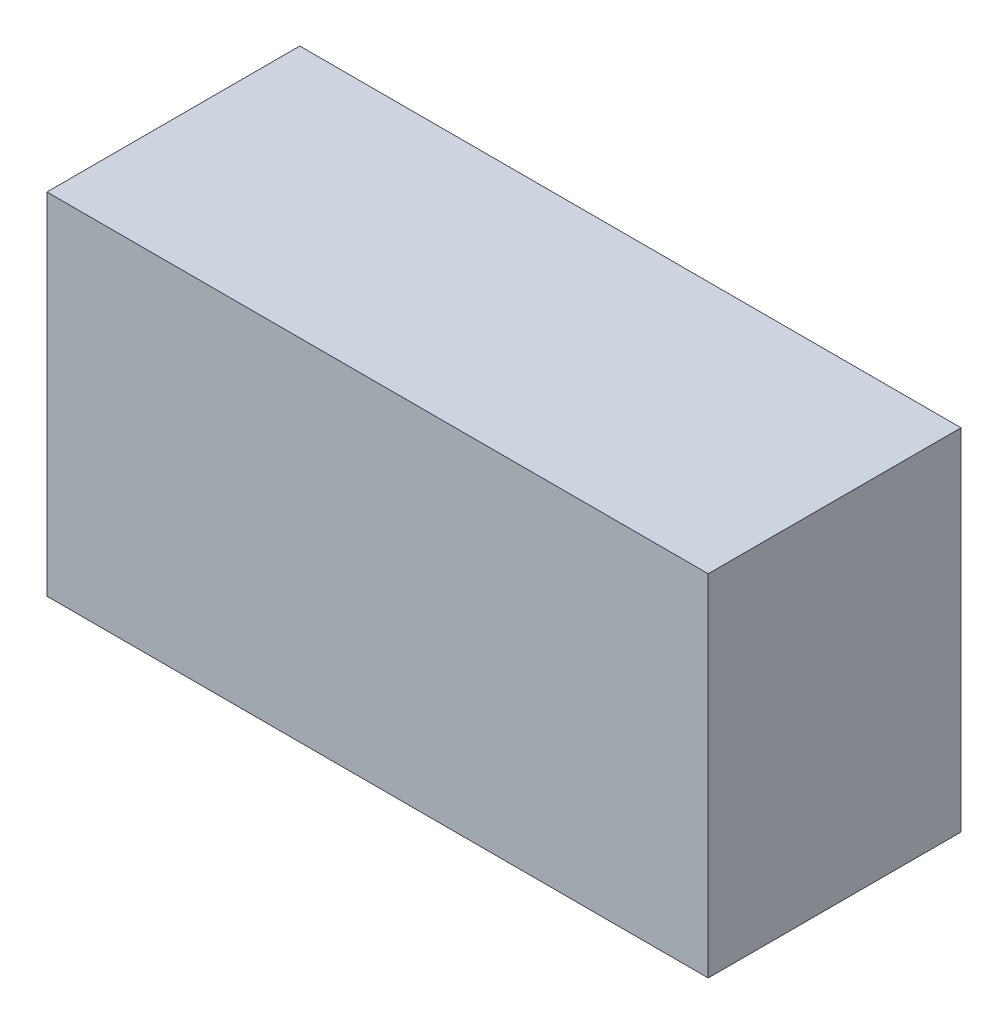
ISO-10303-21;
HEADER;
FILE_DESCRIPTION(('STEP AP214'),'2;1');
FILE_NAME('part.step','',(''),(''),'','','');
FILE_SCHEMA(('AUTOMOTIVE_DESIGN { 1 0 10303 214 1 1 1 1 }'));
ENDSEC;
DATA;
#1=APPLICATION_CONTEXT('core data for automotive mechanical design processes');
#2=APPLICATION_PROTOCOL_DEFINITION('international standard','automotive_design',2000,#1);
#3=PRODUCT_CONTEXT('',#1,'mechanical');
#4=PRODUCT('Part','Part','',(#3));
#5=PRODUCT_RELATED_PRODUCT_CATEGORY('part','',(#4));
#6=PRODUCT_DEFINITION_FORMATION('','',#4);
#7=PRODUCT_DEFINITION_CONTEXT('part definition',#1,'design');
#8=PRODUCT_DEFINITION('design','',#6,#7);
#9=PRODUCT_DEFINITION_SHAPE('','',#8);
#10=(LENGTH_UNIT() NAMED_UNIT(*) SI_UNIT(.MILLI.,.METRE.));
#11=(NAMED_UNIT(*) PLANE_ANGLE_UNIT() SI_UNIT($,.RADIAN.));
#12=(NAMED_UNIT(*) SI_UNIT($,.STERADIAN.) SOLID_ANGLE_UNIT());
#13=UNCERTAINTY_MEASURE_WITH_UNIT(LENGTH_MEASURE(1.E-05),#10,'distance_accuracy_value','');
#14=(GEOMETRIC_REPRESENTATION_CONTEXT(3) GLOBAL_UNCERTAINTY_ASSIGNED_CONTEXT((#13)) GLOBAL_UNIT_ASSIGNED_CONTEXT((#10,
#11,#12)) REPRESENTATION_CONTEXT('',''));
#15=CARTESIAN_POINT('',(0.,0.,0.));
#16=DIRECTION('',(0.,0.,1.));
#17=DIRECTION('',(1.,0.,0.));
#18=AXIS2_PLACEMENT_3D('',#15,#16,#17);
#19=CARTESIAN_POINT('',(-1.69999914,-0.90000074,1.29999994));
#20=DIRECTION('',(0.,0.,-1.));
#21=DIRECTION('',(-1.,0.,0.));
#22=AXIS2_PLACEMENT_3D('',#19,#20,#21);
#23=PLANE('',#22);
#24=DIRECTION('',(0.,1.,0.));
#25=VECTOR('',#24,1.);
#26=CARTESIAN_POINT('',(1.69999914,-0.90000074,1.29999994));
#27=LINE('',#26,#25);
#28=CARTESIAN_POINT('',(1.69999914,-0.90000074,1.29999994));
#29=VERTEX_POINT('',#28);
#30=CARTESIAN_POINT('',(1.69999914,0.90000074,1.29999994));
#31=VERTEX_POINT('',#30);
#32=EDGE_CURVE('E54',#29,#31,#27,.T.);
#33=ORIENTED_EDGE('',*,*,#32,.T.);
#34=DIRECTION('',(1.,0.,0.));
#35=VECTOR('',#34,1.);
#36=CARTESIAN_POINT('',(1.69999914,0.90000074,1.29999994));
#37=LINE('',#36,#35);
#38=CARTESIAN_POINT('',(-1.69999914,0.90000074,1.29999994));
#39=VERTEX_POINT('',#38);
#40=EDGE_CURVE('E56',#31,#39,#37,.F.);
#41=ORIENTED_EDGE('',*,*,#40,.T.);
#42=DIRECTION('',(0.,1.,0.));
#43=VECTOR('',#42,1.);
#44=CARTESIAN_POINT('',(-1.69999914,0.90000074,1.29999994));
#45=LINE('',#44,#43);
#46=CARTESIAN_POINT('',(-1.69999914,-0.90000074,1.29999994));
#47=VERTEX_POINT('',#46);
#48=EDGE_CURVE('E19',#39,#47,#45,.F.);
#49=ORIENTED_EDGE('',*,*,#48,.T.);
#50=DIRECTION('',(1.,0.,0.));
#51=VECTOR('',#50,1.);
#52=CARTESIAN_POINT('',(-1.69999914,-0.90000074,1.29999994));
#53=LINE('',#52,#51);
#54=EDGE_CURVE('E79',#47,#29,#53,.T.);
#55=ORIENTED_EDGE('',*,*,#54,.T.);
#56=EDGE_LOOP('',(#33,#41,#49,#55));
#57=FACE_BOUND('',#56,.T.);
#58=ADVANCED_FACE('F16',(#57),#23,.F.);
#59=CARTESIAN_POINT('',(-1.69999914,0.90000074,0.));
#60=DIRECTION('',(1.,0.,0.));
#61=DIRECTION('',(0.,0.,-1.));
#62=AXIS2_PLACEMENT_3D('',#59,#60,#61);
#63=PLANE('',#62);
#64=DIRECTION('',(0.,0.,1.));
#65=VECTOR('',#64,1.);
#66=CARTESIAN_POINT('',(-1.69999914,-0.90000074,0.));
#67=LINE('',#66,#65);
#68=CARTESIAN_POINT('',(-1.69999914,-0.90000074,0.));
#69=VERTEX_POINT('',#68);
#70=EDGE_CURVE('E67',#69,#47,#67,.T.);
#71=ORIENTED_EDGE('',*,*,#70,.T.);
#72=ORIENTED_EDGE('',*,*,#48,.F.);
#73=DIRECTION('',(0.,0.,-1.));
#74=VECTOR('',#73,1.);
#75=CARTESIAN_POINT('',(-1.69999914,0.90000074,0.));
#76=LINE('',#75,#74);
#77=CARTESIAN_POINT('',(-1.69999914,0.90000074,0.));
#78=VERTEX_POINT('',#77);
#79=EDGE_CURVE('E62',#39,#78,#76,.T.);
#80=ORIENTED_EDGE('',*,*,#79,.T.);
#81=DIRECTION('',(0.,1.,0.));
#82=VECTOR('',#81,1.);
#83=CARTESIAN_POINT('',(-1.69999914,-0.90000074,0.));
#84=LINE('',#83,#82);
#85=EDGE_CURVE('E82',#69,#78,#84,.T.);
#86=ORIENTED_EDGE('',*,*,#85,.F.);
#87=EDGE_LOOP('',(#71,#72,#80,#86));
#88=FACE_BOUND('',#87,.T.);
#89=ADVANCED_FACE('F64',(#88),#63,.F.);
#90=CARTESIAN_POINT('',(1.69999914,0.90000074,0.));
#91=DIRECTION('',(0.,-1.,0.));
#92=DIRECTION('',(0.,0.,-1.));
#93=AXIS2_PLACEMENT_3D('',#90,#91,#92);
#94=PLANE('',#93);
#95=ORIENTED_EDGE('',*,*,#79,.F.);
#96=ORIENTED_EDGE('',*,*,#40,.F.);
#97=DIRECTION('',(0.,0.,1.));
#98=VECTOR('',#97,1.);
#99=CARTESIAN_POINT('',(1.69999914,0.90000074,0.));
#100=LINE('',#99,#98);
#101=CARTESIAN_POINT('',(1.69999914,0.90000074,0.));
#102=VERTEX_POINT('',#101);
#103=EDGE_CURVE('E74',#31,#102,#100,.F.);
#104=ORIENTED_EDGE('',*,*,#103,.T.);
#105=DIRECTION('',(-1.,0.,0.));
#106=VECTOR('',#105,1.);
#107=CARTESIAN_POINT('',(-1.69999914,0.90000074,0.));
#108=LINE('',#107,#106);
#109=EDGE_CURVE('E71',#78,#102,#108,.F.);
#110=ORIENTED_EDGE('',*,*,#109,.F.);
#111=EDGE_LOOP('',(#95,#96,#104,#110));
#112=FACE_BOUND('',#111,.T.);
#113=ADVANCED_FACE('F69',(#112),#94,.F.);
#114=CARTESIAN_POINT('',(1.69999914,-0.90000074,0.));
#115=DIRECTION('',(-1.,0.,0.));
#116=DIRECTION('',(0.,0.,1.));
#117=AXIS2_PLACEMENT_3D('',#114,#115,#116);
#118=PLANE('',#117);
#119=ORIENTED_EDGE('',*,*,#103,.F.);
#120=ORIENTED_EDGE('',*,*,#32,.F.);
#121=DIRECTION('',(0.,0.,1.));
#122=VECTOR('',#121,1.);
#123=CARTESIAN_POINT('',(1.69999914,-0.90000074,0.));
#124=LINE('',#123,#122);
#125=CARTESIAN_POINT('',(1.69999914,-0.90000074,0.));
#126=VERTEX_POINT('',#125);
#127=EDGE_CURVE('E34',#29,#126,#124,.F.);
#128=ORIENTED_EDGE('',*,*,#127,.T.);
#129=DIRECTION('',(0.,1.,0.));
#130=VECTOR('',#129,1.);
#131=CARTESIAN_POINT('',(1.69999914,-0.90000074,0.));
#132=LINE('',#131,#130);
#133=EDGE_CURVE('E25',#102,#126,#132,.F.);
#134=ORIENTED_EDGE('',*,*,#133,.F.);
#135=EDGE_LOOP('',(#119,#120,#128,#134));
#136=FACE_BOUND('',#135,.T.);
#137=ADVANCED_FACE('F88',(#136),#118,.F.);
#138=CARTESIAN_POINT('',(-1.69999914,-0.90000074,0.));
#139=DIRECTION('',(0.,1.,0.));
#140=DIRECTION('',(0.,0.,1.));
#141=AXIS2_PLACEMENT_3D('',#138,#139,#140);
#142=PLANE('',#141);
#143=ORIENTED_EDGE('',*,*,#127,.F.);
#144=ORIENTED_EDGE('',*,*,#54,.F.);
#145=ORIENTED_EDGE('',*,*,#70,.F.);
#146=DIRECTION('',(-1.,0.,0.));
#147=VECTOR('',#146,1.);
#148=CARTESIAN_POINT('',(-1.69999914,-0.90000074,0.));
#149=LINE('',#148,#147);
#150=EDGE_CURVE('E11',#126,#69,#149,.T.);
#151=ORIENTED_EDGE('',*,*,#150,.F.);
#152=EDGE_LOOP('',(#143,#144,#145,#151));
#153=FACE_BOUND('',#152,.T.);
#154=ADVANCED_FACE('F90',(#153),#142,.F.);
#155=CARTESIAN_POINT('',(-1.69999914,-0.90000074,0.));
#156=DIRECTION('',(0.,0.,-1.));
#157=DIRECTION('',(-1.,0.,0.));
#158=AXIS2_PLACEMENT_3D('',#155,#156,#157);
#159=PLANE('',#158);
#160=ORIENTED_EDGE('',*,*,#133,.T.);
#161=ORIENTED_EDGE('',*,*,#150,.T.);
#162=ORIENTED_EDGE('',*,*,#85,.T.);
#163=ORIENTED_EDGE('',*,*,#109,.T.);
#164=EDGE_LOOP('',(#160,#161,#162,#163));
#165=FACE_BOUND('',#164,.T.);
#166=ADVANCED_FACE('F87',(#165),#159,.T.);
#167=CLOSED_SHELL('',(#58,#89,#113,#137,#154,#166));
#168=MANIFOLD_SOLID_BREP('B1',#167);
#169=ADVANCED_BREP_SHAPE_REPRESENTATION('',(#18,#168),#14);
#170=SHAPE_DEFINITION_REPRESENTATION(#9,#169);
ENDSEC;
END-ISO-10303-21;
